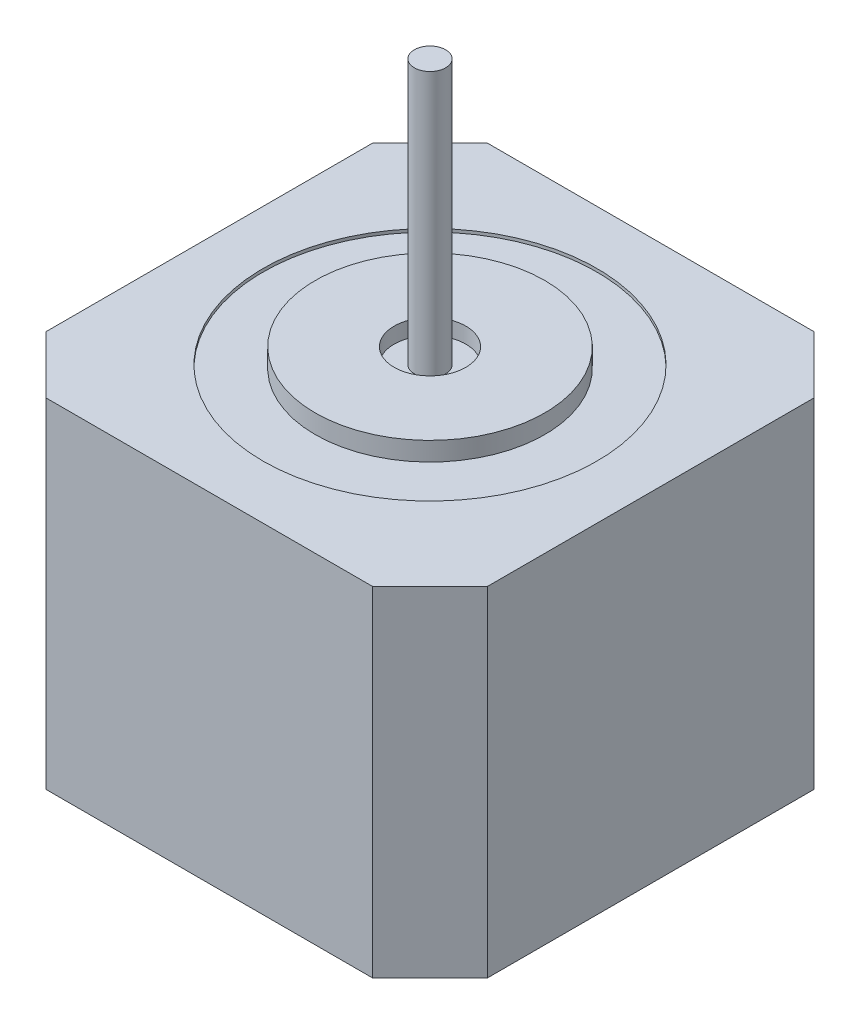
ISO-10303-21;
HEADER;
FILE_DESCRIPTION(('STEP AP214'),'2;1');
FILE_NAME('part.step','',(''),(''),'','','');
FILE_SCHEMA(('AUTOMOTIVE_DESIGN { 1 0 10303 214 1 1 1 1 }'));
ENDSEC;
DATA;
#1=APPLICATION_CONTEXT('core data for automotive mechanical design processes');
#2=APPLICATION_PROTOCOL_DEFINITION('international standard','automotive_design',2000,#1);
#3=PRODUCT_CONTEXT('',#1,'mechanical');
#4=PRODUCT('Part','Part','',(#3));
#5=PRODUCT_RELATED_PRODUCT_CATEGORY('part','',(#4));
#6=PRODUCT_DEFINITION_FORMATION('','',#4);
#7=PRODUCT_DEFINITION_CONTEXT('part definition',#1,'design');
#8=PRODUCT_DEFINITION('design','',#6,#7);
#9=PRODUCT_DEFINITION_SHAPE('','',#8);
#10=(LENGTH_UNIT() NAMED_UNIT(*) SI_UNIT(.MILLI.,.METRE.));
#11=(NAMED_UNIT(*) PLANE_ANGLE_UNIT() SI_UNIT($,.RADIAN.));
#12=(NAMED_UNIT(*) SI_UNIT($,.STERADIAN.) SOLID_ANGLE_UNIT());
#13=UNCERTAINTY_MEASURE_WITH_UNIT(LENGTH_MEASURE(1.E-05),#10,'distance_accuracy_value','');
#14=(GEOMETRIC_REPRESENTATION_CONTEXT(3) GLOBAL_UNCERTAINTY_ASSIGNED_CONTEXT((#13)) GLOBAL_UNIT_ASSIGNED_CONTEXT((#10,
#11,#12)) REPRESENTATION_CONTEXT('',''));
#15=CARTESIAN_POINT('',(0.,0.,0.));
#16=DIRECTION('',(0.,0.,1.));
#17=DIRECTION('',(1.,0.,0.));
#18=AXIS2_PLACEMENT_3D('',#15,#16,#17);
#19=CARTESIAN_POINT('',(0.,34.,0.));
#20=DIRECTION('',(0.,1.,0.));
#21=DIRECTION('',(0.,0.,1.));
#22=AXIS2_PLACEMENT_3D('',#19,#20,#21);
#23=PLANE('',#22);
#24=CARTESIAN_POINT('',(0.,34.,0.));
#25=DIRECTION('',(0.,1.,0.));
#26=DIRECTION('',(0.,0.,1.));
#27=AXIS2_PLACEMENT_3D('',#24,#25,#26);
#28=CIRCLE('',#27,11.);
#29=CARTESIAN_POINT('',(0.,34.,11.));
#30=VERTEX_POINT('',#29);
#31=EDGE_CURVE('E175',#30,#30,#28,.T.);
#32=ORIENTED_EDGE('',*,*,#31,.T.);
#33=EDGE_LOOP('',(#32));
#34=FACE_BOUND('',#33,.T.);
#35=CARTESIAN_POINT('',(0.,34.,0.));
#36=DIRECTION('',(0.,1.,0.));
#37=DIRECTION('',(0.,0.,1.));
#38=AXIS2_PLACEMENT_3D('',#35,#36,#37);
#39=CIRCLE('',#38,3.43085859638425);
#40=CARTESIAN_POINT('',(0.,34.,3.43085859638425));
#41=VERTEX_POINT('',#40);
#42=EDGE_CURVE('E180',#41,#41,#39,.T.);
#43=ORIENTED_EDGE('',*,*,#42,.F.);
#44=EDGE_LOOP('',(#43));
#45=FACE_BOUND('',#44,.T.);
#46=ADVANCED_FACE('F32',(#34,#45),#23,.T.);
#47=CARTESIAN_POINT('',(0.,34.,0.));
#48=DIRECTION('',(0.,-1.,0.));
#49=DIRECTION('',(0.,0.,-1.));
#50=AXIS2_PLACEMENT_3D('',#47,#48,#49);
#51=CYLINDRICAL_SURFACE('',#50,11.);
#52=ORIENTED_EDGE('',*,*,#31,.F.);
#53=EDGE_LOOP('',(#52));
#54=FACE_BOUND('',#53,.T.);
#55=CARTESIAN_POINT('',(0.,32.2,0.));
#56=DIRECTION('',(0.,1.,0.));
#57=DIRECTION('',(0.,0.,1.));
#58=AXIS2_PLACEMENT_3D('',#55,#56,#57);
#59=CIRCLE('',#58,11.);
#60=CARTESIAN_POINT('',(0.,32.2,11.));
#61=VERTEX_POINT('',#60);
#62=EDGE_CURVE('E194',#61,#61,#59,.T.);
#63=ORIENTED_EDGE('',*,*,#62,.T.);
#64=EDGE_LOOP('',(#63));
#65=FACE_BOUND('',#64,.T.);
#66=ADVANCED_FACE('F221',(#54,#65),#51,.T.);
#67=CARTESIAN_POINT('',(0.,34.,0.));
#68=DIRECTION('',(0.,-1.,0.));
#69=DIRECTION('',(0.,0.,-1.));
#70=AXIS2_PLACEMENT_3D('',#67,#68,#69);
#71=CYLINDRICAL_SURFACE('',#70,3.43085859638425);
#72=ORIENTED_EDGE('',*,*,#42,.T.);
#73=EDGE_LOOP('',(#72));
#74=FACE_BOUND('',#73,.T.);
#75=CARTESIAN_POINT('',(0.,32.5,0.));
#76=DIRECTION('',(0.,1.,0.));
#77=DIRECTION('',(0.,0.,1.));
#78=AXIS2_PLACEMENT_3D('',#75,#76,#77);
#79=CIRCLE('',#78,3.43085859638425);
#80=CARTESIAN_POINT('',(0.,32.5,3.43085859638425));
#81=VERTEX_POINT('',#80);
#82=EDGE_CURVE('E184',#81,#81,#79,.T.);
#83=ORIENTED_EDGE('',*,*,#82,.F.);
#84=EDGE_LOOP('',(#83));
#85=FACE_BOUND('',#84,.T.);
#86=ADVANCED_FACE('F216',(#74,#85),#71,.F.);
#87=CARTESIAN_POINT('',(0.,32.5,0.));
#88=DIRECTION('',(0.,-1.,0.));
#89=DIRECTION('',(0.,0.,-1.));
#90=AXIS2_PLACEMENT_3D('',#87,#88,#89);
#91=PLANE('',#90);
#92=CARTESIAN_POINT('',(0.,32.5,0.));
#93=DIRECTION('',(0.,-1.,0.));
#94=DIRECTION('',(0.,0.,-1.));
#95=AXIS2_PLACEMENT_3D('',#92,#93,#94);
#96=CIRCLE('',#95,1.5);
#97=CARTESIAN_POINT('',(0.,32.5,-1.5));
#98=VERTEX_POINT('',#97);
#99=EDGE_CURVE('E11',#98,#98,#96,.F.);
#100=ORIENTED_EDGE('',*,*,#99,.F.);
#101=EDGE_LOOP('',(#100));
#102=FACE_BOUND('',#101,.T.);
#103=ORIENTED_EDGE('',*,*,#82,.T.);
#104=EDGE_LOOP('',(#103));
#105=FACE_BOUND('',#104,.T.);
#106=ADVANCED_FACE('F212',(#102,#105),#91,.F.);
#107=CARTESIAN_POINT('',(0.,32.2,0.));
#108=DIRECTION('',(0.,1.,0.));
#109=DIRECTION('',(0.,0.,1.));
#110=AXIS2_PLACEMENT_3D('',#107,#108,#109);
#111=CYLINDRICAL_SURFACE('',#110,16.);
#112=CARTESIAN_POINT('',(0.,32.2,0.));
#113=DIRECTION('',(0.,1.,0.));
#114=DIRECTION('',(0.,0.,1.));
#115=AXIS2_PLACEMENT_3D('',#112,#113,#114);
#116=CIRCLE('',#115,16.);
#117=CARTESIAN_POINT('',(0.,32.2,16.));
#118=VERTEX_POINT('',#117);
#119=EDGE_CURVE('E189',#118,#118,#116,.T.);
#120=ORIENTED_EDGE('',*,*,#119,.F.);
#121=EDGE_LOOP('',(#120));
#122=FACE_BOUND('',#121,.T.);
#123=CARTESIAN_POINT('',(0.,32.5,0.));
#124=DIRECTION('',(0.,1.,0.));
#125=DIRECTION('',(0.,0.,1.));
#126=AXIS2_PLACEMENT_3D('',#123,#124,#125);
#127=CIRCLE('',#126,16.);
#128=CARTESIAN_POINT('',(0.,32.5,16.));
#129=VERTEX_POINT('',#128);
#130=EDGE_CURVE('E191',#129,#129,#127,.T.);
#131=ORIENTED_EDGE('',*,*,#130,.T.);
#132=EDGE_LOOP('',(#131));
#133=FACE_BOUND('',#132,.T.);
#134=ADVANCED_FACE('F215',(#122,#133),#111,.F.);
#135=CARTESIAN_POINT('',(0.,32.2,0.));
#136=DIRECTION('',(0.,1.,0.));
#137=DIRECTION('',(0.,0.,1.));
#138=AXIS2_PLACEMENT_3D('',#135,#136,#137);
#139=PLANE('',#138);
#140=ORIENTED_EDGE('',*,*,#62,.F.);
#141=EDGE_LOOP('',(#140));
#142=FACE_BOUND('',#141,.T.);
#143=ORIENTED_EDGE('',*,*,#119,.T.);
#144=EDGE_LOOP('',(#143));
#145=FACE_BOUND('',#144,.T.);
#146=ADVANCED_FACE('F241',(#142,#145),#139,.T.);
#147=CARTESIAN_POINT('',(0.,0.,0.));
#148=DIRECTION('',(0.,-1.,0.));
#149=DIRECTION('',(0.,0.,-1.));
#150=AXIS2_PLACEMENT_3D('',#147,#148,#149);
#151=PLANE('',#150);
#152=DIRECTION('',(0.,0.,1.));
#153=VECTOR('',#152,1.);
#154=CARTESIAN_POINT('',(-21.15,0.,21.15));
#155=LINE('',#154,#153);
#156=CARTESIAN_POINT('',(-21.15,0.,-15.65));
#157=VERTEX_POINT('',#156);
#158=CARTESIAN_POINT('',(-21.15,0.,15.65));
#159=VERTEX_POINT('',#158);
#160=EDGE_CURVE('E115',#157,#159,#155,.T.);
#161=ORIENTED_EDGE('',*,*,#160,.F.);
#162=DIRECTION('',(-0.707106781186548,0.,0.707106781186547));
#163=VECTOR('',#162,1.);
#164=CARTESIAN_POINT('',(-18.4,0.,-18.4));
#165=LINE('',#164,#163);
#166=CARTESIAN_POINT('',(-15.65,0.,-21.15));
#167=VERTEX_POINT('',#166);
#168=EDGE_CURVE('E98',#157,#167,#165,.F.);
#169=ORIENTED_EDGE('',*,*,#168,.T.);
#170=DIRECTION('',(-1.,0.,0.));
#171=VECTOR('',#170,1.);
#172=CARTESIAN_POINT('',(-21.15,0.,-21.15));
#173=LINE('',#172,#171);
#174=CARTESIAN_POINT('',(15.65,0.,-21.15));
#175=VERTEX_POINT('',#174);
#176=EDGE_CURVE('E124',#175,#167,#173,.T.);
#177=ORIENTED_EDGE('',*,*,#176,.F.);
#178=DIRECTION('',(-0.707106781186546,0.,-0.707106781186549));
#179=VECTOR('',#178,1.);
#180=CARTESIAN_POINT('',(18.4,0.,-18.4));
#181=LINE('',#180,#179);
#182=CARTESIAN_POINT('',(21.15,0.,-15.65));
#183=VERTEX_POINT('',#182);
#184=EDGE_CURVE('E109',#175,#183,#181,.F.);
#185=ORIENTED_EDGE('',*,*,#184,.T.);
#186=DIRECTION('',(0.,0.,-1.));
#187=VECTOR('',#186,1.);
#188=CARTESIAN_POINT('',(21.15,0.,21.15));
#189=LINE('',#188,#187);
#190=CARTESIAN_POINT('',(21.15,0.,15.65));
#191=VERTEX_POINT('',#190);
#192=EDGE_CURVE('E128',#191,#183,#189,.T.);
#193=ORIENTED_EDGE('',*,*,#192,.F.);
#194=DIRECTION('',(0.707106781186548,0.,-0.707106781186547));
#195=VECTOR('',#194,1.);
#196=CARTESIAN_POINT('',(18.4,0.,18.4));
#197=LINE('',#196,#195);
#198=CARTESIAN_POINT('',(15.65,0.,21.15));
#199=VERTEX_POINT('',#198);
#200=EDGE_CURVE('E135',#191,#199,#197,.F.);
#201=ORIENTED_EDGE('',*,*,#200,.T.);
#202=DIRECTION('',(1.,0.,0.));
#203=VECTOR('',#202,1.);
#204=CARTESIAN_POINT('',(-21.15,0.,21.15));
#205=LINE('',#204,#203);
#206=CARTESIAN_POINT('',(-15.65,0.,21.15));
#207=VERTEX_POINT('',#206);
#208=EDGE_CURVE('E123',#207,#199,#205,.T.);
#209=ORIENTED_EDGE('',*,*,#208,.F.);
#210=DIRECTION('',(0.707106781186546,0.,0.707106781186549));
#211=VECTOR('',#210,1.);
#212=CARTESIAN_POINT('',(-18.4,0.,18.4));
#213=LINE('',#212,#211);
#214=EDGE_CURVE('E118',#207,#159,#213,.F.);
#215=ORIENTED_EDGE('',*,*,#214,.T.);
#216=EDGE_LOOP('',(#161,#169,#177,#185,#193,#201,#209,#215));
#217=FACE_BOUND('',#216,.T.);
#218=ADVANCED_FACE('F121',(#217),#151,.T.);
#219=CARTESIAN_POINT('',(15.65,32.5,-21.15));
#220=DIRECTION('',(-0.707106781186549,0.,0.707106781186546));
#221=DIRECTION('',(0.,-1.,0.));
#222=AXIS2_PLACEMENT_3D('',#219,#220,#221);
#223=PLANE('',#222);
#224=DIRECTION('',(0.707106781186546,0.,0.707106781186549));
#225=VECTOR('',#224,1.);
#226=CARTESIAN_POINT('',(15.65,32.5,-21.15));
#227=LINE('',#226,#225);
#228=CARTESIAN_POINT('',(21.15,32.5,-15.65));
#229=VERTEX_POINT('',#228);
#230=CARTESIAN_POINT('',(15.65,32.5,-21.15));
#231=VERTEX_POINT('',#230);
#232=EDGE_CURVE('E144',#229,#231,#227,.F.);
#233=ORIENTED_EDGE('',*,*,#232,.F.);
#234=DIRECTION('',(0.,1.,0.));
#235=VECTOR('',#234,1.);
#236=CARTESIAN_POINT('',(21.15,32.5,-15.65));
#237=LINE('',#236,#235);
#238=EDGE_CURVE('E151',#183,#229,#237,.T.);
#239=ORIENTED_EDGE('',*,*,#238,.F.);
#240=ORIENTED_EDGE('',*,*,#184,.F.);
#241=DIRECTION('',(0.,-1.,0.));
#242=VECTOR('',#241,1.);
#243=CARTESIAN_POINT('',(15.65,32.5,-21.15));
#244=LINE('',#243,#242);
#245=EDGE_CURVE('E108',#231,#175,#244,.T.);
#246=ORIENTED_EDGE('',*,*,#245,.F.);
#247=EDGE_LOOP('',(#233,#239,#240,#246));
#248=FACE_BOUND('',#247,.T.);
#249=ADVANCED_FACE('F240',(#248),#223,.F.);
#250=CARTESIAN_POINT('',(21.15,32.5,21.15));
#251=DIRECTION('',(-1.,0.,0.));
#252=DIRECTION('',(0.,0.,1.));
#253=AXIS2_PLACEMENT_3D('',#250,#251,#252);
#254=PLANE('',#253);
#255=ORIENTED_EDGE('',*,*,#192,.T.);
#256=ORIENTED_EDGE('',*,*,#238,.T.);
#257=DIRECTION('',(0.,0.,-1.));
#258=VECTOR('',#257,1.);
#259=CARTESIAN_POINT('',(21.15,32.5,21.15));
#260=LINE('',#259,#258);
#261=CARTESIAN_POINT('',(21.15,32.5,15.65));
#262=VERTEX_POINT('',#261);
#263=EDGE_CURVE('E126',#262,#229,#260,.T.);
#264=ORIENTED_EDGE('',*,*,#263,.F.);
#265=DIRECTION('',(0.,-1.,0.));
#266=VECTOR('',#265,1.);
#267=CARTESIAN_POINT('',(21.15,32.5,15.65));
#268=LINE('',#267,#266);
#269=EDGE_CURVE('E148',#262,#191,#268,.T.);
#270=ORIENTED_EDGE('',*,*,#269,.T.);
#271=EDGE_LOOP('',(#255,#256,#264,#270));
#272=FACE_BOUND('',#271,.T.);
#273=ADVANCED_FACE('F166',(#272),#254,.F.);
#274=CARTESIAN_POINT('',(21.15,32.5,15.65));
#275=DIRECTION('',(-0.707106781186547,0.,-0.707106781186548));
#276=DIRECTION('',(0.,-1.,0.));
#277=AXIS2_PLACEMENT_3D('',#274,#275,#276);
#278=PLANE('',#277);
#279=DIRECTION('',(-0.707106781186548,0.,0.707106781186547));
#280=VECTOR('',#279,1.);
#281=CARTESIAN_POINT('',(21.15,32.5,15.65));
#282=LINE('',#281,#280);
#283=CARTESIAN_POINT('',(15.65,32.5,21.15));
#284=VERTEX_POINT('',#283);
#285=EDGE_CURVE('E142',#284,#262,#282,.F.);
#286=ORIENTED_EDGE('',*,*,#285,.F.);
#287=DIRECTION('',(0.,1.,0.));
#288=VECTOR('',#287,1.);
#289=CARTESIAN_POINT('',(15.65,32.5,21.15));
#290=LINE('',#289,#288);
#291=EDGE_CURVE('E40',#199,#284,#290,.T.);
#292=ORIENTED_EDGE('',*,*,#291,.F.);
#293=ORIENTED_EDGE('',*,*,#200,.F.);
#294=ORIENTED_EDGE('',*,*,#269,.F.);
#295=EDGE_LOOP('',(#286,#292,#293,#294));
#296=FACE_BOUND('',#295,.T.);
#297=ADVANCED_FACE('F163',(#296),#278,.F.);
#298=CARTESIAN_POINT('',(-21.15,32.5,21.15));
#299=DIRECTION('',(0.,0.,-1.));
#300=DIRECTION('',(-1.,0.,0.));
#301=AXIS2_PLACEMENT_3D('',#298,#299,#300);
#302=PLANE('',#301);
#303=ORIENTED_EDGE('',*,*,#208,.T.);
#304=ORIENTED_EDGE('',*,*,#291,.T.);
#305=DIRECTION('',(1.,0.,0.));
#306=VECTOR('',#305,1.);
#307=CARTESIAN_POINT('',(-21.15,32.5,21.15));
#308=LINE('',#307,#306);
#309=CARTESIAN_POINT('',(-15.65,32.5,21.15));
#310=VERTEX_POINT('',#309);
#311=EDGE_CURVE('E132',#310,#284,#308,.T.);
#312=ORIENTED_EDGE('',*,*,#311,.F.);
#313=DIRECTION('',(0.,-1.,0.));
#314=VECTOR('',#313,1.);
#315=CARTESIAN_POINT('',(-15.65,32.5,21.15));
#316=LINE('',#315,#314);
#317=EDGE_CURVE('E153',#310,#207,#316,.T.);
#318=ORIENTED_EDGE('',*,*,#317,.T.);
#319=EDGE_LOOP('',(#303,#304,#312,#318));
#320=FACE_BOUND('',#319,.T.);
#321=ADVANCED_FACE('F156',(#320),#302,.F.);
#322=CARTESIAN_POINT('',(-15.65,32.5,21.15));
#323=DIRECTION('',(0.707106781186549,0.,-0.707106781186546));
#324=DIRECTION('',(0.,-1.,0.));
#325=AXIS2_PLACEMENT_3D('',#322,#323,#324);
#326=PLANE('',#325);
#327=DIRECTION('',(-0.707106781186546,0.,-0.707106781186549));
#328=VECTOR('',#327,1.);
#329=CARTESIAN_POINT('',(-15.65,32.5,21.15));
#330=LINE('',#329,#328);
#331=CARTESIAN_POINT('',(-21.15,32.5,15.65));
#332=VERTEX_POINT('',#331);
#333=EDGE_CURVE('E53',#332,#310,#330,.F.);
#334=ORIENTED_EDGE('',*,*,#333,.F.);
#335=DIRECTION('',(0.,1.,0.));
#336=VECTOR('',#335,1.);
#337=CARTESIAN_POINT('',(-21.15,32.5,15.65));
#338=LINE('',#337,#336);
#339=EDGE_CURVE('E119',#159,#332,#338,.T.);
#340=ORIENTED_EDGE('',*,*,#339,.F.);
#341=ORIENTED_EDGE('',*,*,#214,.F.);
#342=ORIENTED_EDGE('',*,*,#317,.F.);
#343=EDGE_LOOP('',(#334,#340,#341,#342));
#344=FACE_BOUND('',#343,.T.);
#345=ADVANCED_FACE('F34',(#344),#326,.F.);
#346=CARTESIAN_POINT('',(-21.15,32.5,21.15));
#347=DIRECTION('',(1.,0.,0.));
#348=DIRECTION('',(0.,0.,-1.));
#349=AXIS2_PLACEMENT_3D('',#346,#347,#348);
#350=PLANE('',#349);
#351=DIRECTION('',(0.,0.,1.));
#352=VECTOR('',#351,1.);
#353=CARTESIAN_POINT('',(-21.15,32.5,21.15));
#354=LINE('',#353,#352);
#355=CARTESIAN_POINT('',(-21.15,32.5,-15.65));
#356=VERTEX_POINT('',#355);
#357=EDGE_CURVE('E117',#356,#332,#354,.T.);
#358=ORIENTED_EDGE('',*,*,#357,.F.);
#359=DIRECTION('',(0.,-1.,0.));
#360=VECTOR('',#359,1.);
#361=CARTESIAN_POINT('',(-21.15,32.5,-15.65));
#362=LINE('',#361,#360);
#363=EDGE_CURVE('E102',#356,#157,#362,.T.);
#364=ORIENTED_EDGE('',*,*,#363,.T.);
#365=ORIENTED_EDGE('',*,*,#160,.T.);
#366=ORIENTED_EDGE('',*,*,#339,.T.);
#367=EDGE_LOOP('',(#358,#364,#365,#366));
#368=FACE_BOUND('',#367,.T.);
#369=ADVANCED_FACE('F114',(#368),#350,.F.);
#370=CARTESIAN_POINT('',(-21.15,32.5,-15.65));
#371=DIRECTION('',(0.707106781186547,0.,0.707106781186548));
#372=DIRECTION('',(0.,-1.,0.));
#373=AXIS2_PLACEMENT_3D('',#370,#371,#372);
#374=PLANE('',#373);
#375=DIRECTION('',(0.707106781186548,0.,-0.707106781186547));
#376=VECTOR('',#375,1.);
#377=CARTESIAN_POINT('',(-21.15,32.5,-15.65));
#378=LINE('',#377,#376);
#379=CARTESIAN_POINT('',(-15.65,32.5,-21.15));
#380=VERTEX_POINT('',#379);
#381=EDGE_CURVE('E146',#380,#356,#378,.F.);
#382=ORIENTED_EDGE('',*,*,#381,.F.);
#383=DIRECTION('',(0.,1.,0.));
#384=VECTOR('',#383,1.);
#385=CARTESIAN_POINT('',(-15.65,32.5,-21.15));
#386=LINE('',#385,#384);
#387=EDGE_CURVE('E103',#167,#380,#386,.T.);
#388=ORIENTED_EDGE('',*,*,#387,.F.);
#389=ORIENTED_EDGE('',*,*,#168,.F.);
#390=ORIENTED_EDGE('',*,*,#363,.F.);
#391=EDGE_LOOP('',(#382,#388,#389,#390));
#392=FACE_BOUND('',#391,.T.);
#393=ADVANCED_FACE('F101',(#392),#374,.F.);
#394=CARTESIAN_POINT('',(-21.15,32.5,-21.15));
#395=DIRECTION('',(0.,0.,1.));
#396=DIRECTION('',(1.,0.,0.));
#397=AXIS2_PLACEMENT_3D('',#394,#395,#396);
#398=PLANE('',#397);
#399=ORIENTED_EDGE('',*,*,#176,.T.);
#400=ORIENTED_EDGE('',*,*,#387,.T.);
#401=DIRECTION('',(-1.,0.,0.));
#402=VECTOR('',#401,1.);
#403=CARTESIAN_POINT('',(-21.15,32.5,-21.15));
#404=LINE('',#403,#402);
#405=EDGE_CURVE('E170',#231,#380,#404,.T.);
#406=ORIENTED_EDGE('',*,*,#405,.F.);
#407=ORIENTED_EDGE('',*,*,#245,.T.);
#408=EDGE_LOOP('',(#399,#400,#406,#407));
#409=FACE_BOUND('',#408,.T.);
#410=ADVANCED_FACE('F236',(#409),#398,.F.);
#411=ORIENTED_EDGE('',*,*,#130,.F.);
#412=EDGE_LOOP('',(#411));
#413=FACE_BOUND('',#412,.T.);
#414=ORIENTED_EDGE('',*,*,#405,.T.);
#415=ORIENTED_EDGE('',*,*,#381,.T.);
#416=ORIENTED_EDGE('',*,*,#357,.T.);
#417=ORIENTED_EDGE('',*,*,#333,.T.);
#418=ORIENTED_EDGE('',*,*,#311,.T.);
#419=ORIENTED_EDGE('',*,*,#285,.T.);
#420=ORIENTED_EDGE('',*,*,#263,.T.);
#421=ORIENTED_EDGE('',*,*,#232,.T.);
#422=EDGE_LOOP('',(#414,#415,#416,#417,#418,#419,#420,#421));
#423=FACE_BOUND('',#422,.T.);
#424=ADVANCED_FACE('F208',(#413,#423),#91,.F.);
#425=CARTESIAN_POINT('',(0.,57.9,0.));
#426=DIRECTION('',(0.,-1.,0.));
#427=DIRECTION('',(0.,0.,-1.));
#428=AXIS2_PLACEMENT_3D('',#425,#426,#427);
#429=CYLINDRICAL_SURFACE('',#428,1.5);
#430=CARTESIAN_POINT('',(0.,57.9,0.));
#431=DIRECTION('',(0.,1.,0.));
#432=DIRECTION('',(0.,0.,1.));
#433=AXIS2_PLACEMENT_3D('',#430,#431,#432);
#434=CIRCLE('',#433,1.5);
#435=CARTESIAN_POINT('',(0.,57.9,1.5));
#436=VERTEX_POINT('',#435);
#437=EDGE_CURVE('E199',#436,#436,#434,.T.);
#438=ORIENTED_EDGE('',*,*,#437,.F.);
#439=EDGE_LOOP('',(#438));
#440=FACE_BOUND('',#439,.T.);
#441=ORIENTED_EDGE('',*,*,#99,.T.);
#442=EDGE_LOOP('',(#441));
#443=FACE_BOUND('',#442,.T.);
#444=ADVANCED_FACE('F205',(#440,#443),#429,.T.);
#445=CARTESIAN_POINT('',(0.,57.9,0.));
#446=DIRECTION('',(0.,1.,0.));
#447=DIRECTION('',(0.,0.,1.));
#448=AXIS2_PLACEMENT_3D('',#445,#446,#447);
#449=PLANE('',#448);
#450=ORIENTED_EDGE('',*,*,#437,.T.);
#451=EDGE_LOOP('',(#450));
#452=FACE_BOUND('',#451,.T.);
#453=ADVANCED_FACE('F203',(#452),#449,.T.);
#454=CLOSED_SHELL('',(#46,#66,#86,#106,#134,#146,#218,#249,#273,#297,#321,#345,#369,#393,#410,
#424,#444,#453));
#455=MANIFOLD_SOLID_BREP('B2',#454);
#456=ADVANCED_BREP_SHAPE_REPRESENTATION('',(#18,#455),#14);
#457=SHAPE_DEFINITION_REPRESENTATION(#9,#456);
ENDSEC;
END-ISO-10303-21;
